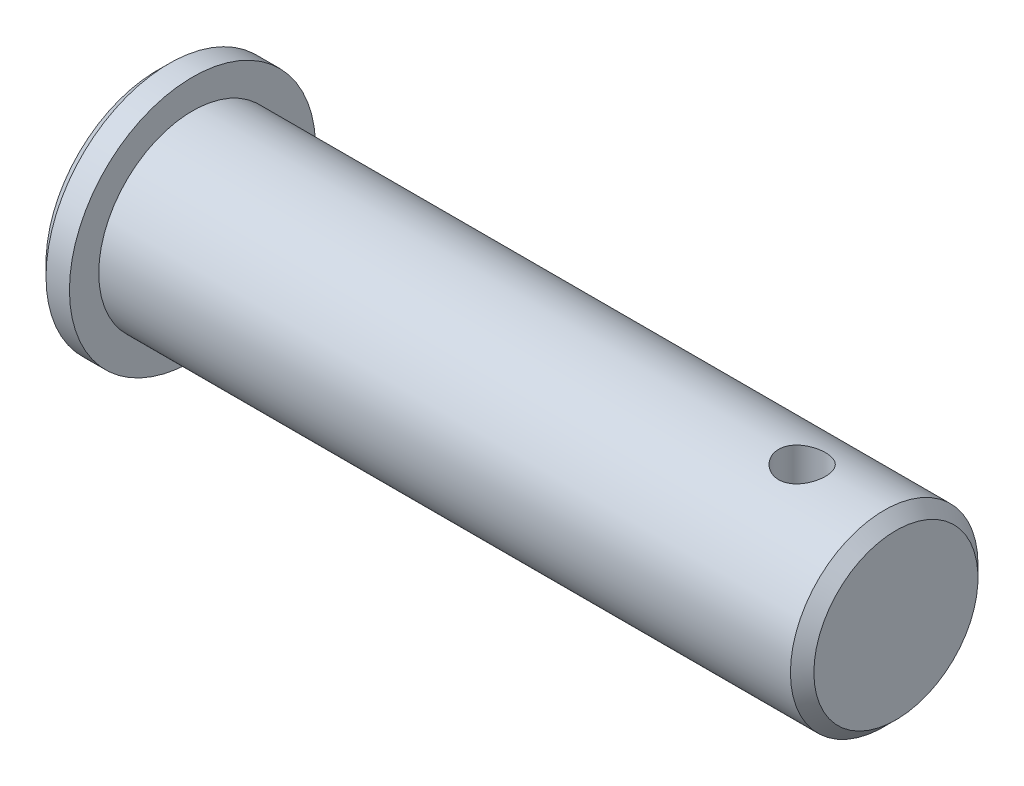
ISO-10303-21;
HEADER;
FILE_DESCRIPTION(('STEP AP214'),'2;1');
FILE_NAME('part.step','',(''),(''),'','','');
FILE_SCHEMA(('AUTOMOTIVE_DESIGN { 1 0 10303 214 1 1 1 1 }'));
ENDSEC;
DATA;
#1=APPLICATION_CONTEXT('core data for automotive mechanical design processes');
#2=APPLICATION_PROTOCOL_DEFINITION('international standard','automotive_design',2000,#1);
#3=PRODUCT_CONTEXT('',#1,'mechanical');
#4=PRODUCT('Part','Part','',(#3));
#5=PRODUCT_RELATED_PRODUCT_CATEGORY('part','',(#4));
#6=PRODUCT_DEFINITION_FORMATION('','',#4);
#7=PRODUCT_DEFINITION_CONTEXT('part definition',#1,'design');
#8=PRODUCT_DEFINITION('design','',#6,#7);
#9=PRODUCT_DEFINITION_SHAPE('','',#8);
#10=(LENGTH_UNIT() NAMED_UNIT(*) SI_UNIT(.MILLI.,.METRE.));
#11=(NAMED_UNIT(*) PLANE_ANGLE_UNIT() SI_UNIT($,.RADIAN.));
#12=(NAMED_UNIT(*) SI_UNIT($,.STERADIAN.) SOLID_ANGLE_UNIT());
#13=UNCERTAINTY_MEASURE_WITH_UNIT(LENGTH_MEASURE(1.E-05),#10,'distance_accuracy_value','');
#14=(GEOMETRIC_REPRESENTATION_CONTEXT(3) GLOBAL_UNCERTAINTY_ASSIGNED_CONTEXT((#13)) GLOBAL_UNIT_ASSIGNED_CONTEXT((#10,
#11,#12)) REPRESENTATION_CONTEXT('',''));
#15=CARTESIAN_POINT('',(0.,0.,0.));
#16=DIRECTION('',(0.,0.,1.));
#17=DIRECTION('',(1.,0.,0.));
#18=AXIS2_PLACEMENT_3D('',#15,#16,#17);
#19=CARTESIAN_POINT('',(63.,0.,0.));
#20=DIRECTION('',(-1.,0.,0.));
#21=DIRECTION('',(0.,0.,1.));
#22=AXIS2_PLACEMENT_3D('',#19,#20,#21);
#23=PLANE('',#22);
#24=CARTESIAN_POINT('',(63.,0.,0.));
#25=DIRECTION('',(-1.,0.,0.));
#26=DIRECTION('',(0.,0.,1.));
#27=AXIS2_PLACEMENT_3D('',#24,#25,#26);
#28=CIRCLE('',#27,7.00000000000001);
#29=CARTESIAN_POINT('',(63.,0.,7.00000000000001));
#30=VERTEX_POINT('',#29);
#31=EDGE_CURVE('E60',#30,#30,#28,.F.);
#32=ORIENTED_EDGE('',*,*,#31,.T.);
#33=EDGE_LOOP('',(#32));
#34=FACE_BOUND('',#33,.T.);
#35=ADVANCED_FACE('F39',(#34),#23,.F.);
#36=CARTESIAN_POINT('',(0.,0.,0.));
#37=DIRECTION('',(-1.,0.,0.));
#38=DIRECTION('',(0.,0.,1.));
#39=AXIS2_PLACEMENT_3D('',#36,#37,#38);
#40=CYLINDRICAL_SURFACE('',#39,8.);
#41=CARTESIAN_POINT('',(55.,-7.74596669241483,2.));
#42=CARTESIAN_POINT('',(55.1104406007413,-7.74596880070288,1.99999686287446));
#43=CARTESIAN_POINT('',(55.2209159189428,-7.74835444811678,1.99082099639812));
#44=CARTESIAN_POINT('',(55.4386940625388,-7.75761489594051,1.95441850037104));
#45=CARTESIAN_POINT('',(55.5459950035746,-7.76449230897304,1.92718136539369));
#46=CARTESIAN_POINT('',(55.7542428305497,-7.7819097967692,1.85559295970564));
#47=CARTESIAN_POINT('',(55.8551977243086,-7.79244514152366,1.8112637822836));
#48=CARTESIAN_POINT('',(56.0482486820319,-7.81598553623007,1.70681691300911));
#49=CARTESIAN_POINT('',(56.1403443696642,-7.82899069102791,1.64669855084855));
#50=CARTESIAN_POINT('',(56.3150893162098,-7.856325730845,1.51096674184951));
#51=CARTESIAN_POINT('',(56.39751488028,-7.87067678098427,1.43506951016324));
#52=CARTESIAN_POINT('',(56.5486091154883,-7.89890300412235,1.27054565128053));
#53=CARTESIAN_POINT('',(56.6172765004974,-7.91277813253111,1.18191783534425));
#54=CARTESIAN_POINT('',(56.739820374105,-7.93872332416466,0.992916160863166));
#55=CARTESIAN_POINT('',(56.7934771105292,-7.95076549920474,0.892395660956097));
#56=CARTESIAN_POINT('',(56.8830477153225,-7.97144649540787,0.683410547434209));
#57=CARTESIAN_POINT('',(56.9189642015324,-7.98008581867475,0.574947108633552));
#58=CARTESIAN_POINT('',(56.9713182676629,-7.99283807078544,0.355487007003329));
#59=CARTESIAN_POINT('',(56.9881357154613,-7.99703915075451,0.244586175639181));
#60=CARTESIAN_POINT('',(57.0030067034204,-8.00074875285838,0.0214630554102156));
#61=CARTESIAN_POINT('',(57.0010630177677,-8.00025796877363,-0.0907590356304551));
#62=CARTESIAN_POINT('',(56.9787401197999,-7.99470475962828,-0.310704494344775));
#63=CARTESIAN_POINT('',(56.9587709399569,-7.98974401872699,-0.418472431202135));
#64=CARTESIAN_POINT('',(56.9016229839612,-7.97592669219883,-0.629076494827374));
#65=CARTESIAN_POINT('',(56.8644432916981,-7.96706989918753,-0.731912358740878));
#66=CARTESIAN_POINT('',(56.7735979434503,-7.94630007760717,-0.930813407003616));
#67=CARTESIAN_POINT('',(56.7197863642706,-7.93436015756043,-1.02680901953301));
#68=CARTESIAN_POINT('',(56.597315456707,-7.90871923047719,-1.20855124468098));
#69=CARTESIAN_POINT('',(56.5286535451515,-7.89501791721992,-1.29429607017101));
#70=CARTESIAN_POINT('',(56.3762330064141,-7.86690971015616,-1.45554807016992));
#71=CARTESIAN_POINT('',(56.2921160861218,-7.85249375620734,-1.5307153581504));
#72=CARTESIAN_POINT('',(56.1123200211678,-7.82492034813365,-1.66595275192604));
#73=CARTESIAN_POINT('',(56.0166403364072,-7.81176295284776,-1.72602215209204));
#74=CARTESIAN_POINT('',(55.8157679726808,-7.78816397465319,-1.8295762580452));
#75=CARTESIAN_POINT('',(55.7105314157494,-7.77773586980576,-1.87297913394098));
#76=CARTESIAN_POINT('',(55.4939316255388,-7.76094912111965,-1.94137124127268));
#77=CARTESIAN_POINT('',(55.3825697088135,-7.75458960648175,-1.96636441310582));
#78=CARTESIAN_POINT('',(55.1600323987815,-7.74684284831312,-1.99666371093214));
#79=CARTESIAN_POINT('',(55.0489297653363,-7.74532871274919,-2.00247237913571));
#80=CARTESIAN_POINT('',(54.8273424507375,-7.74709874784831,-1.99561359241244));
#81=CARTESIAN_POINT('',(54.716857713639,-7.75038247681013,-1.98294783827904));
#82=CARTESIAN_POINT('',(54.5015085880362,-7.76125665563648,-1.93994037115013));
#83=CARTESIAN_POINT('',(54.3965818187433,-7.768775761875,-1.9098912546254));
#84=CARTESIAN_POINT('',(54.1932548337187,-7.7872057461677,-1.8332944653365));
#85=CARTESIAN_POINT('',(54.0948553927557,-7.79811702598891,-1.78674483817004));
#86=CARTESIAN_POINT('',(53.9052469777061,-7.8223690967461,-1.67741653434925));
#87=CARTESIAN_POINT('',(53.8142169279655,-7.83575334885313,-1.61433740306851));
#88=CARTESIAN_POINT('',(53.6438493097589,-7.86333666457373,-1.47412058586891));
#89=CARTESIAN_POINT('',(53.5645136666799,-7.87753586182776,-1.39698058961088));
#90=CARTESIAN_POINT('',(53.4177511659432,-7.90557922425285,-1.22852544196945));
#91=CARTESIAN_POINT('',(53.3506719499609,-7.91940561649468,-1.13690390506319));
#92=CARTESIAN_POINT('',(53.232851306439,-7.94477773290988,-0.943405365389353));
#93=CARTESIAN_POINT('',(53.1821090267134,-7.95632357603169,-0.841528897915183));
#94=CARTESIAN_POINT('',(53.0988431723777,-7.9757609259065,-0.631116403462182));
#95=CARTESIAN_POINT('',(53.0661885724967,-7.98367864017925,-0.522634762055766));
#96=CARTESIAN_POINT('',(53.0196317323133,-7.99508234716634,-0.301499520637615));
#97=CARTESIAN_POINT('',(53.0057258730088,-7.99856919514738,-0.188846730082481));
#98=CARTESIAN_POINT('',(52.9972648208489,-8.00068338817612,0.0341670528866464));
#99=CARTESIAN_POINT('',(53.0021965818092,-7.99943957759977,0.144507653932043));
#100=CARTESIAN_POINT('',(53.0300956545887,-7.99251792914887,0.362734992829502));
#101=CARTESIAN_POINT('',(53.0530624300263,-7.98684022314338,0.470621803561858));
#102=CARTESIAN_POINT('',(53.1161044395417,-7.97170865707778,0.68034207128955));
#103=CARTESIAN_POINT('',(53.1560869066288,-7.96227529004785,0.782204989161727));
#104=CARTESIAN_POINT('',(53.2519411580391,-7.94062577827316,0.97783410608325));
#105=CARTESIAN_POINT('',(53.307814945341,-7.92840928277515,1.07159928253127));
#106=CARTESIAN_POINT('',(53.4354304679923,-7.90214499360574,1.25080385684661));
#107=CARTESIAN_POINT('',(53.5075202858077,-7.88806033883329,1.33598997659668));
#108=CARTESIAN_POINT('',(53.6648457039547,-7.85981298114379,1.49323004054701));
#109=CARTESIAN_POINT('',(53.7500846322223,-7.84565025934604,1.56528065015318));
#110=CARTESIAN_POINT('',(53.9332028283789,-7.81854951691005,1.69552405294367));
#111=CARTESIAN_POINT('',(54.0312882467305,-7.80563927346578,1.75343323883276));
#112=CARTESIAN_POINT('',(54.2361109797496,-7.78287910989656,1.85185379317094));
#113=CARTESIAN_POINT('',(54.3428419321877,-7.77302696466427,1.89237781950431));
#114=CARTESIAN_POINT('',(54.5411540236703,-7.75903817501474,1.94884505714201));
#115=CARTESIAN_POINT('',(54.6317863287723,-7.75417326006998,1.96798634119376));
#116=CARTESIAN_POINT('',(54.8149377379954,-7.7476367716524,1.99356458514354));
#117=CARTESIAN_POINT('',(54.9074566804888,-7.74596492578216,2.0000026287435));
#118=CARTESIAN_POINT('',(55.,-7.74596669241483,2.));
#119=B_SPLINE_CURVE_WITH_KNOTS('',3,(#41,#42,#43,#44,#45,#46,#47,#48,#49,#50,#51,#52,#53,#54,
#55,#56,#57,#58,#59,#60,#61,#62,#63,#64,#65,#66,#67,#68,#69,#70,#71,#72,#73,#74,#75,#76,#77,#78,
#79,#80,#81,#82,#83,#84,#85,#86,#87,#88,#89,#90,#91,#92,#93,#94,#95,#96,#97,#98,#99,#100,#101,
#102,#103,#104,#105,#106,#107,#108,#109,#110,#111,#112,#113,#114,#115,#116,#117,#118),
.UNSPECIFIED.,.T.,.F.,(4,2,2,2,2,2,2,2,2,2,2,2,2,2,2,2,2,2,2,2,2,2,2,2,2,2,2,2,2,2,2,2,2,2,2,2,
2,2,4),(0.,0.330981953388917,0.662156593142934,0.992904581732809,1.32366661404383,
1.66099163354381,1.99834817183894,2.34041197118337,2.68242527877674,3.01751000796278,
3.35254518932817,3.68014610151158,4.0077644537983,4.33834299403557,4.66897908375132,
5.0085637325753,5.34816424959843,5.68941145606723,6.03058560103639,6.36274859809376,
6.69488101747043,7.02157924007367,7.34831617137135,7.68146276687327,8.01466415108037,
8.35620264772257,8.69772332575644,9.03673658245545,9.37568439127232,9.70546756901967,
10.0352409390159,10.3632390124777,10.6912784459046,11.0271767726566,11.3631602525241,
11.7054118182895,12.0474137709606,12.3247826174463,12.6021278008238),.UNSPECIFIED.);
#120=CARTESIAN_POINT('',(55.,-7.74596669241483,2.));
#121=VERTEX_POINT('',#120);
#122=EDGE_CURVE('E44',#121,#121,#119,.T.);
#123=ORIENTED_EDGE('',*,*,#122,.T.);
#124=EDGE_LOOP('',(#123));
#125=FACE_BOUND('',#124,.T.);
#126=CARTESIAN_POINT('',(55.,7.74596669241483,2.));
#127=CARTESIAN_POINT('',(54.8895593992587,7.74596880070288,1.99999686287446));
#128=CARTESIAN_POINT('',(54.7790840810572,7.74835444811678,1.99082099639812));
#129=CARTESIAN_POINT('',(54.5613059374612,7.75761489594051,1.95441850037104));
#130=CARTESIAN_POINT('',(54.4540049964254,7.76449230897304,1.92718136539369));
#131=CARTESIAN_POINT('',(54.2457571694503,7.7819097967692,1.85559295970563));
#132=CARTESIAN_POINT('',(54.1448022756914,7.79244514152366,1.8112637822836));
#133=CARTESIAN_POINT('',(53.9517513179681,7.81598553623007,1.70681691300911));
#134=CARTESIAN_POINT('',(53.8596556303358,7.82899069102791,1.64669855084855));
#135=CARTESIAN_POINT('',(53.6849106837902,7.856325730845,1.51096674184951));
#136=CARTESIAN_POINT('',(53.60248511972,7.87067678098427,1.43506951016324));
#137=CARTESIAN_POINT('',(53.4513908845117,7.89890300412235,1.27054565128053));
#138=CARTESIAN_POINT('',(53.3827234995026,7.91277813253111,1.18191783534425));
#139=CARTESIAN_POINT('',(53.260179625895,7.93872332416466,0.992916160863166));
#140=CARTESIAN_POINT('',(53.2065228894708,7.95076549920474,0.892395660956097));
#141=CARTESIAN_POINT('',(53.1169522846775,7.97144649540787,0.683410547434209));
#142=CARTESIAN_POINT('',(53.0810357984676,7.98008581867475,0.574947108633552));
#143=CARTESIAN_POINT('',(53.0286817323371,7.99283807078544,0.355487007003329));
#144=CARTESIAN_POINT('',(53.0118642845387,7.99703915075451,0.244586175639181));
#145=CARTESIAN_POINT('',(52.9969932965796,8.00074875285838,0.021463055410216));
#146=CARTESIAN_POINT('',(52.9989369822323,8.00025796877363,-0.0907590356304547));
#147=CARTESIAN_POINT('',(53.0212598802001,7.99470475962828,-0.310704494344774));
#148=CARTESIAN_POINT('',(53.0412290600431,7.98974401872699,-0.418472431202133));
#149=CARTESIAN_POINT('',(53.0983770160388,7.97592669219883,-0.629076494827373));
#150=CARTESIAN_POINT('',(53.1355567083019,7.96706989918753,-0.731912358740878));
#151=CARTESIAN_POINT('',(53.2264020565497,7.94630007760717,-0.930813407003616));
#152=CARTESIAN_POINT('',(53.2802136357294,7.93436015756043,-1.02680901953301));
#153=CARTESIAN_POINT('',(53.402684543293,7.90871923047719,-1.20855124468098));
#154=CARTESIAN_POINT('',(53.4713464548485,7.89501791721992,-1.29429607017102));
#155=CARTESIAN_POINT('',(53.6237669935859,7.86690971015616,-1.45554807016992));
#156=CARTESIAN_POINT('',(53.7078839138782,7.85249375620734,-1.53071535815041));
#157=CARTESIAN_POINT('',(53.8876799788322,7.82492034813365,-1.66595275192604));
#158=CARTESIAN_POINT('',(53.9833596635928,7.81176295284776,-1.72602215209204));
#159=CARTESIAN_POINT('',(54.1842320273192,7.78816397465319,-1.8295762580452));
#160=CARTESIAN_POINT('',(54.2894685842506,7.77773586980576,-1.87297913394099));
#161=CARTESIAN_POINT('',(54.5060683744612,7.76094912111965,-1.94137124127269));
#162=CARTESIAN_POINT('',(54.6174302911865,7.75458960648175,-1.96636441310582));
#163=CARTESIAN_POINT('',(54.8399676012185,7.74684284831312,-1.99666371093214));
#164=CARTESIAN_POINT('',(54.9510702346637,7.74532871274918,-2.00247237913571));
#165=CARTESIAN_POINT('',(55.1726575492625,7.74709874784831,-1.99561359241244));
#166=CARTESIAN_POINT('',(55.283142286361,7.75038247681013,-1.98294783827904));
#167=CARTESIAN_POINT('',(55.4984914119638,7.76125665563648,-1.93994037115013));
#168=CARTESIAN_POINT('',(55.6034181812567,7.768775761875,-1.9098912546254));
#169=CARTESIAN_POINT('',(55.8067451662813,7.7872057461677,-1.8332944653365));
#170=CARTESIAN_POINT('',(55.9051446072443,7.79811702598891,-1.78674483817004));
#171=CARTESIAN_POINT('',(56.0947530222939,7.8223690967461,-1.67741653434925));
#172=CARTESIAN_POINT('',(56.1857830720345,7.83575334885313,-1.61433740306851));
#173=CARTESIAN_POINT('',(56.3561506902411,7.86333666457373,-1.47412058586891));
#174=CARTESIAN_POINT('',(56.4354863333201,7.87753586182776,-1.39698058961088));
#175=CARTESIAN_POINT('',(56.5822488340568,7.90557922425285,-1.22852544196945));
#176=CARTESIAN_POINT('',(56.6493280500391,7.91940561649468,-1.13690390506319));
#177=CARTESIAN_POINT('',(56.767148693561,7.94477773290988,-0.943405365389353));
#178=CARTESIAN_POINT('',(56.8178909732866,7.95632357603169,-0.841528897915183));
#179=CARTESIAN_POINT('',(56.9011568276223,7.9757609259065,-0.631116403462181));
#180=CARTESIAN_POINT('',(56.9338114275033,7.98367864017925,-0.522634762055765));
#181=CARTESIAN_POINT('',(56.9803682676867,7.99508234716634,-0.301499520637615));
#182=CARTESIAN_POINT('',(56.9942741269912,7.99856919514738,-0.188846730082482));
#183=CARTESIAN_POINT('',(57.0027351791511,8.00068338817612,0.0341670528866458));
#184=CARTESIAN_POINT('',(56.9978034181908,7.99943957759977,0.144507653932043));
#185=CARTESIAN_POINT('',(56.9699043454113,7.99251792914887,0.362734992829502));
#186=CARTESIAN_POINT('',(56.9469375699737,7.98684022314338,0.470621803561858));
#187=CARTESIAN_POINT('',(56.8838955604583,7.97170865707778,0.68034207128955));
#188=CARTESIAN_POINT('',(56.8439130933712,7.96227529004785,0.782204989161727));
#189=CARTESIAN_POINT('',(56.7480588419609,7.94062577827316,0.97783410608325));
#190=CARTESIAN_POINT('',(56.692185054659,7.92840928277515,1.07159928253127));
#191=CARTESIAN_POINT('',(56.5645695320077,7.90214499360574,1.25080385684661));
#192=CARTESIAN_POINT('',(56.4924797141923,7.88806033883329,1.33598997659668));
#193=CARTESIAN_POINT('',(56.3351542960453,7.85981298114379,1.49323004054701));
#194=CARTESIAN_POINT('',(56.2499153677777,7.84565025934604,1.56528065015318));
#195=CARTESIAN_POINT('',(56.0667971716211,7.81854951691005,1.69552405294367));
#196=CARTESIAN_POINT('',(55.9687117532695,7.80563927346578,1.75343323883276));
#197=CARTESIAN_POINT('',(55.7638890202504,7.78287910989656,1.85185379317094));
#198=CARTESIAN_POINT('',(55.6571580678123,7.77302696466427,1.89237781950431));
#199=CARTESIAN_POINT('',(55.4588459763297,7.75903817501474,1.94884505714201));
#200=CARTESIAN_POINT('',(55.3682136712277,7.75417326006998,1.96798634119376));
#201=CARTESIAN_POINT('',(55.1850622620046,7.7476367716524,1.99356458514354));
#202=CARTESIAN_POINT('',(55.0925433195112,7.74596492578215,2.0000026287435));
#203=CARTESIAN_POINT('',(55.,7.74596669241483,2.));
#204=B_SPLINE_CURVE_WITH_KNOTS('',3,(#126,#127,#128,#129,#130,#131,#132,#133,#134,#135,#136,
#137,#138,#139,#140,#141,#142,#143,#144,#145,#146,#147,#148,#149,#150,#151,#152,#153,#154,#155,
#156,#157,#158,#159,#160,#161,#162,#163,#164,#165,#166,#167,#168,#169,#170,#171,#172,#173,#174,
#175,#176,#177,#178,#179,#180,#181,#182,#183,#184,#185,#186,#187,#188,#189,#190,#191,#192,#193,
#194,#195,#196,#197,#198,#199,#200,#201,#202,#203),.UNSPECIFIED.,.T.,.F.,(4,2,2,2,2,2,2,2,2,2,2,
2,2,2,2,2,2,2,2,2,2,2,2,2,2,2,2,2,2,2,2,2,2,2,2,2,2,2,4),(0.,0.330981953388917,
0.662156593142934,0.992904581732817,1.32366661404383,1.66099163354381,1.99834817183894,
2.34041197118337,2.68242527877674,3.01751000796278,3.35254518932817,3.68014610151158,
4.0077644537983,4.33834299403557,4.66897908375132,5.00856373257531,5.34816424959843,
5.68941145606724,6.03058560103639,6.36274859809375,6.69488101747043,7.02157924007367,
7.34831617137135,7.68146276687327,8.01466415108037,8.35620264772257,8.69772332575644,
9.03673658245545,9.37568439127232,9.70546756901966,10.0352409390159,10.3632390124777,
10.6912784459046,11.0271767726566,11.3631602525241,11.7054118182895,12.0474137709606,
12.3247826174463,12.6021278008238),.UNSPECIFIED.);
#205=CARTESIAN_POINT('',(55.,7.74596669241483,2.));
#206=VERTEX_POINT('',#205);
#207=EDGE_CURVE('E63',#206,#206,#204,.T.);
#208=ORIENTED_EDGE('',*,*,#207,.T.);
#209=EDGE_LOOP('',(#208));
#210=FACE_BOUND('',#209,.T.);
#211=CARTESIAN_POINT('',(62.,0.,0.));
#212=DIRECTION('',(-1.,0.,0.));
#213=DIRECTION('',(0.,0.,1.));
#214=AXIS2_PLACEMENT_3D('',#211,#212,#213);
#215=CIRCLE('',#214,8.);
#216=CARTESIAN_POINT('',(62.,0.,8.));
#217=VERTEX_POINT('',#216);
#218=EDGE_CURVE('E113',#217,#217,#215,.T.);
#219=ORIENTED_EDGE('',*,*,#218,.T.);
#220=EDGE_LOOP('',(#219));
#221=FACE_BOUND('',#220,.T.);
#222=CARTESIAN_POINT('',(3.,0.,0.));
#223=DIRECTION('',(-1.,0.,0.));
#224=DIRECTION('',(0.,0.,1.));
#225=AXIS2_PLACEMENT_3D('',#222,#223,#224);
#226=CIRCLE('',#225,8.);
#227=CARTESIAN_POINT('',(3.,0.,8.));
#228=VERTEX_POINT('',#227);
#229=EDGE_CURVE('E116',#228,#228,#226,.T.);
#230=ORIENTED_EDGE('',*,*,#229,.F.);
#231=EDGE_LOOP('',(#230));
#232=FACE_BOUND('',#231,.T.);
#233=ADVANCED_FACE('F69',(#125,#210,#221,#232),#40,.T.);
#234=CARTESIAN_POINT('',(3.,10.5,0.));
#235=DIRECTION('',(-1.,0.,0.));
#236=DIRECTION('',(0.,0.,1.));
#237=AXIS2_PLACEMENT_3D('',#234,#235,#236);
#238=PLANE('',#237);
#239=CARTESIAN_POINT('',(3.,0.,0.));
#240=DIRECTION('',(-1.,0.,0.));
#241=DIRECTION('',(0.,0.,1.));
#242=AXIS2_PLACEMENT_3D('',#239,#240,#241);
#243=CIRCLE('',#242,10.5);
#244=CARTESIAN_POINT('',(3.,0.,10.5));
#245=VERTEX_POINT('',#244);
#246=EDGE_CURVE('E121',#245,#245,#243,.T.);
#247=ORIENTED_EDGE('',*,*,#246,.F.);
#248=EDGE_LOOP('',(#247));
#249=FACE_BOUND('',#248,.T.);
#250=ORIENTED_EDGE('',*,*,#229,.T.);
#251=EDGE_LOOP('',(#250));
#252=FACE_BOUND('',#251,.T.);
#253=ADVANCED_FACE('F86',(#249,#252),#238,.F.);
#254=CARTESIAN_POINT('',(0.,0.,0.));
#255=DIRECTION('',(-1.,0.,0.));
#256=DIRECTION('',(0.,0.,1.));
#257=AXIS2_PLACEMENT_3D('',#254,#255,#256);
#258=CYLINDRICAL_SURFACE('',#257,10.5);
#259=CARTESIAN_POINT('',(1.00000000000002,0.,0.));
#260=DIRECTION('',(1.,0.,0.));
#261=DIRECTION('',(0.,0.,-1.));
#262=AXIS2_PLACEMENT_3D('',#259,#260,#261);
#263=CIRCLE('',#262,10.5);
#264=CARTESIAN_POINT('',(1.00000000000002,0.,-10.5));
#265=VERTEX_POINT('',#264);
#266=EDGE_CURVE('E10',#265,#265,#263,.T.);
#267=ORIENTED_EDGE('',*,*,#266,.T.);
#268=EDGE_LOOP('',(#267));
#269=FACE_BOUND('',#268,.T.);
#270=ORIENTED_EDGE('',*,*,#246,.T.);
#271=EDGE_LOOP('',(#270));
#272=FACE_BOUND('',#271,.T.);
#273=ADVANCED_FACE('F83',(#269,#272),#258,.T.);
#274=CARTESIAN_POINT('',(0.,0.,0.));
#275=DIRECTION('',(1.,0.,0.));
#276=DIRECTION('',(0.,0.,-1.));
#277=AXIS2_PLACEMENT_3D('',#274,#275,#276);
#278=PLANE('',#277);
#279=CARTESIAN_POINT('',(0.,0.,0.));
#280=DIRECTION('',(1.,0.,0.));
#281=DIRECTION('',(0.,0.,-1.));
#282=AXIS2_PLACEMENT_3D('',#279,#280,#281);
#283=CIRCLE('',#282,9.49999999999999);
#284=CARTESIAN_POINT('',(0.,0.,-9.49999999999999));
#285=VERTEX_POINT('',#284);
#286=EDGE_CURVE('E54',#285,#285,#283,.F.);
#287=ORIENTED_EDGE('',*,*,#286,.T.);
#288=EDGE_LOOP('',(#287));
#289=FACE_BOUND('',#288,.T.);
#290=ADVANCED_FACE('F78',(#289),#278,.F.);
#291=CARTESIAN_POINT('',(62.,0.,0.));
#292=DIRECTION('',(-1.,0.,0.));
#293=DIRECTION('',(0.,0.,1.));
#294=AXIS2_PLACEMENT_3D('',#291,#292,#293);
#295=CONICAL_SURFACE('',#294,8.,0.785398163397448);
#296=ORIENTED_EDGE('',*,*,#31,.F.);
#297=EDGE_LOOP('',(#296));
#298=FACE_BOUND('',#297,.T.);
#299=ORIENTED_EDGE('',*,*,#218,.F.);
#300=EDGE_LOOP('',(#299));
#301=FACE_BOUND('',#300,.T.);
#302=ADVANCED_FACE('F82',(#298,#301),#295,.T.);
#303=CARTESIAN_POINT('',(0.,0.,0.));
#304=DIRECTION('',(1.,0.,0.));
#305=DIRECTION('',(0.,0.,-1.));
#306=AXIS2_PLACEMENT_3D('',#303,#304,#305);
#307=CONICAL_SURFACE('',#306,9.49999999999999,0.785398163397443);
#308=ORIENTED_EDGE('',*,*,#266,.F.);
#309=EDGE_LOOP('',(#308));
#310=FACE_BOUND('',#309,.T.);
#311=ORIENTED_EDGE('',*,*,#286,.F.);
#312=EDGE_LOOP('',(#311));
#313=FACE_BOUND('',#312,.T.);
#314=ADVANCED_FACE('F42',(#310,#313),#307,.T.);
#315=CARTESIAN_POINT('',(55.,-10.5,0.));
#316=DIRECTION('',(0.,1.,0.));
#317=DIRECTION('',(0.,0.,1.));
#318=AXIS2_PLACEMENT_3D('',#315,#316,#317);
#319=CYLINDRICAL_SURFACE('',#318,2.);
#320=ORIENTED_EDGE('',*,*,#207,.F.);
#321=EDGE_LOOP('',(#320));
#322=FACE_BOUND('',#321,.T.);
#323=ORIENTED_EDGE('',*,*,#122,.F.);
#324=EDGE_LOOP('',(#323));
#325=FACE_BOUND('',#324,.T.);
#326=ADVANCED_FACE('F73',(#322,#325),#319,.F.);
#327=CLOSED_SHELL('',(#35,#233,#253,#273,#290,#302,#314,#326));
#328=MANIFOLD_SOLID_BREP('B2',#327);
#329=ADVANCED_BREP_SHAPE_REPRESENTATION('',(#18,#328),#14);
#330=SHAPE_DEFINITION_REPRESENTATION(#9,#329);
ENDSEC;
END-ISO-10303-21;
